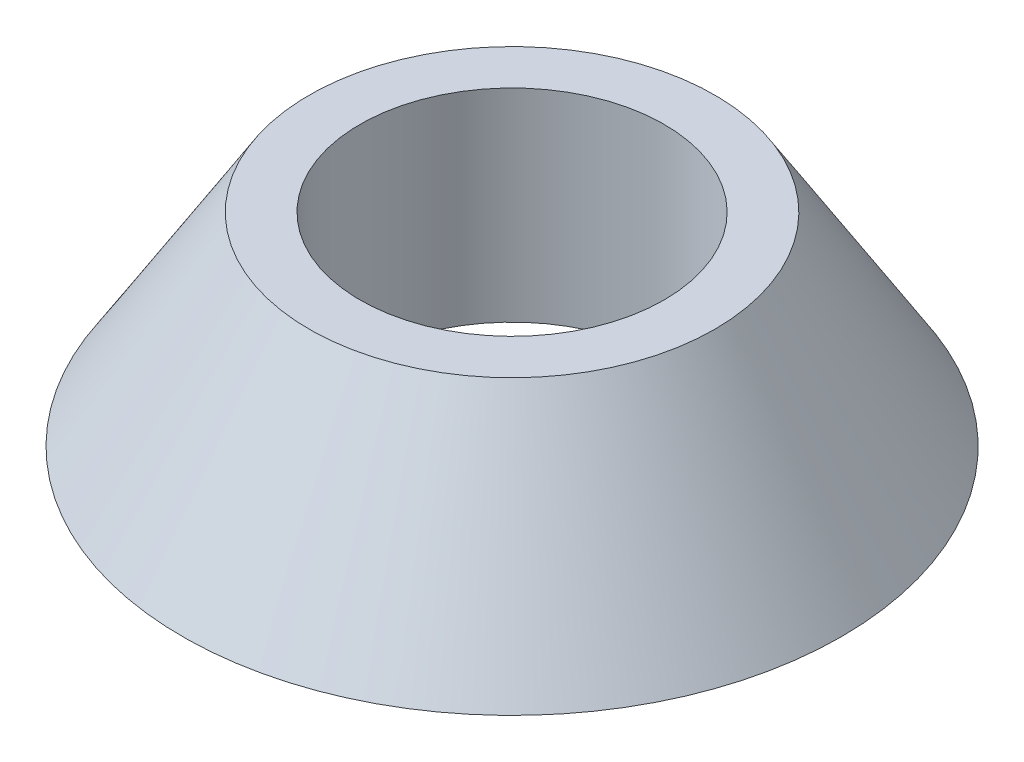
ISO-10303-21;
HEADER;
FILE_DESCRIPTION(('STEP AP214'),'2;1');
FILE_NAME('part.step','',(''),(''),'','','');
FILE_SCHEMA(('AUTOMOTIVE_DESIGN { 1 0 10303 214 1 1 1 1 }'));
ENDSEC;
DATA;
#1=APPLICATION_CONTEXT('core data for automotive mechanical design processes');
#2=APPLICATION_PROTOCOL_DEFINITION('international standard','automotive_design',2000,#1);
#3=PRODUCT_CONTEXT('',#1,'mechanical');
#4=PRODUCT('Part','Part','',(#3));
#5=PRODUCT_RELATED_PRODUCT_CATEGORY('part','',(#4));
#6=PRODUCT_DEFINITION_FORMATION('','',#4);
#7=PRODUCT_DEFINITION_CONTEXT('part definition',#1,'design');
#8=PRODUCT_DEFINITION('design','',#6,#7);
#9=PRODUCT_DEFINITION_SHAPE('','',#8);
#10=(LENGTH_UNIT() NAMED_UNIT(*) SI_UNIT(.MILLI.,.METRE.));
#11=(NAMED_UNIT(*) PLANE_ANGLE_UNIT() SI_UNIT($,.RADIAN.));
#12=(NAMED_UNIT(*) SI_UNIT($,.STERADIAN.) SOLID_ANGLE_UNIT());
#13=UNCERTAINTY_MEASURE_WITH_UNIT(LENGTH_MEASURE(1.E-05),#10,'distance_accuracy_value','');
#14=(GEOMETRIC_REPRESENTATION_CONTEXT(3) GLOBAL_UNCERTAINTY_ASSIGNED_CONTEXT((#13)) GLOBAL_UNIT_ASSIGNED_CONTEXT((#10,
#11,#12)) REPRESENTATION_CONTEXT('',''));
#15=CARTESIAN_POINT('',(0.,0.,0.));
#16=DIRECTION('',(0.,0.,1.));
#17=DIRECTION('',(1.,0.,0.));
#18=AXIS2_PLACEMENT_3D('',#15,#16,#17);
#19=CARTESIAN_POINT('',(6.5,0.,0.));
#20=DIRECTION('',(0.,-1.,0.));
#21=DIRECTION('',(1.,0.,0.));
#22=AXIS2_PLACEMENT_3D('',#19,#20,#21);
#23=PLANE('',#22);
#24=CARTESIAN_POINT('',(0.,0.,0.));
#25=DIRECTION('',(0.,1.,0.));
#26=DIRECTION('',(1.,0.,0.));
#27=AXIS2_PLACEMENT_3D('',#24,#25,#26);
#28=CIRCLE('',#27,6.5);
#29=CARTESIAN_POINT('',(6.5,0.,0.));
#30=VERTEX_POINT('',#29);
#31=EDGE_CURVE('E49',#30,#30,#28,.T.);
#32=ORIENTED_EDGE('',*,*,#31,.F.);
#33=EDGE_LOOP('',(#32));
#34=FACE_BOUND('',#33,.T.);
#35=CARTESIAN_POINT('',(0.,0.,0.));
#36=DIRECTION('',(0.,1.,0.));
#37=DIRECTION('',(1.,0.,0.));
#38=AXIS2_PLACEMENT_3D('',#35,#36,#37);
#39=CIRCLE('',#38,3.);
#40=CARTESIAN_POINT('',(3.,0.,0.));
#41=VERTEX_POINT('',#40);
#42=EDGE_CURVE('E10',#41,#41,#39,.T.);
#43=ORIENTED_EDGE('',*,*,#42,.T.);
#44=EDGE_LOOP('',(#43));
#45=FACE_BOUND('',#44,.T.);
#46=ADVANCED_FACE('F35',(#34,#45),#23,.T.);
#47=CARTESIAN_POINT('',(0.,0.,0.));
#48=DIRECTION('',(0.,-1.,0.));
#49=DIRECTION('',(1.,0.,0.));
#50=AXIS2_PLACEMENT_3D('',#47,#48,#49);
#51=CYLINDRICAL_SURFACE('',#50,3.00000000000001);
#52=ORIENTED_EDGE('',*,*,#42,.F.);
#53=EDGE_LOOP('',(#52));
#54=FACE_BOUND('',#53,.T.);
#55=CARTESIAN_POINT('',(0.,3.99999999999999,0.));
#56=DIRECTION('',(0.,1.,0.));
#57=DIRECTION('',(1.,0.,0.));
#58=AXIS2_PLACEMENT_3D('',#55,#56,#57);
#59=CIRCLE('',#58,3.00000000000001);
#60=CARTESIAN_POINT('',(3.,4.,0.));
#61=VERTEX_POINT('',#60);
#62=EDGE_CURVE('E41',#61,#61,#59,.T.);
#63=ORIENTED_EDGE('',*,*,#62,.T.);
#64=EDGE_LOOP('',(#63));
#65=FACE_BOUND('',#64,.T.);
#66=ADVANCED_FACE('F58',(#54,#65),#51,.F.);
#67=CARTESIAN_POINT('',(3.,4.,0.));
#68=DIRECTION('',(0.,1.,0.));
#69=DIRECTION('',(-1.,0.,0.));
#70=AXIS2_PLACEMENT_3D('',#67,#68,#69);
#71=PLANE('',#70);
#72=ORIENTED_EDGE('',*,*,#62,.F.);
#73=EDGE_LOOP('',(#72));
#74=FACE_BOUND('',#73,.T.);
#75=CARTESIAN_POINT('',(0.,3.99999999999999,0.));
#76=DIRECTION('',(0.,1.,0.));
#77=DIRECTION('',(1.,0.,0.));
#78=AXIS2_PLACEMENT_3D('',#75,#76,#77);
#79=CIRCLE('',#78,4.00000000000001);
#80=CARTESIAN_POINT('',(4.,4.,0.));
#81=VERTEX_POINT('',#80);
#82=EDGE_CURVE('E45',#81,#81,#79,.T.);
#83=ORIENTED_EDGE('',*,*,#82,.T.);
#84=EDGE_LOOP('',(#83));
#85=FACE_BOUND('',#84,.T.);
#86=ADVANCED_FACE('F62',(#74,#85),#71,.T.);
#87=CARTESIAN_POINT('',(0.,0.,0.));
#88=DIRECTION('',(0.,-1.,0.));
#89=DIRECTION('',(1.,0.,0.));
#90=AXIS2_PLACEMENT_3D('',#87,#88,#89);
#91=CONICAL_SURFACE('',#90,6.5,0.558599315343559);
#92=ORIENTED_EDGE('',*,*,#82,.F.);
#93=EDGE_LOOP('',(#92));
#94=FACE_BOUND('',#93,.T.);
#95=ORIENTED_EDGE('',*,*,#31,.T.);
#96=EDGE_LOOP('',(#95));
#97=FACE_BOUND('',#96,.T.);
#98=ADVANCED_FACE('F55',(#94,#97),#91,.T.);
#99=CLOSED_SHELL('',(#46,#66,#86,#98));
#100=MANIFOLD_SOLID_BREP('B2',#99);
#101=ADVANCED_BREP_SHAPE_REPRESENTATION('',(#18,#100),#14);
#102=SHAPE_DEFINITION_REPRESENTATION(#9,#101);
ENDSEC;
END-ISO-10303-21;
